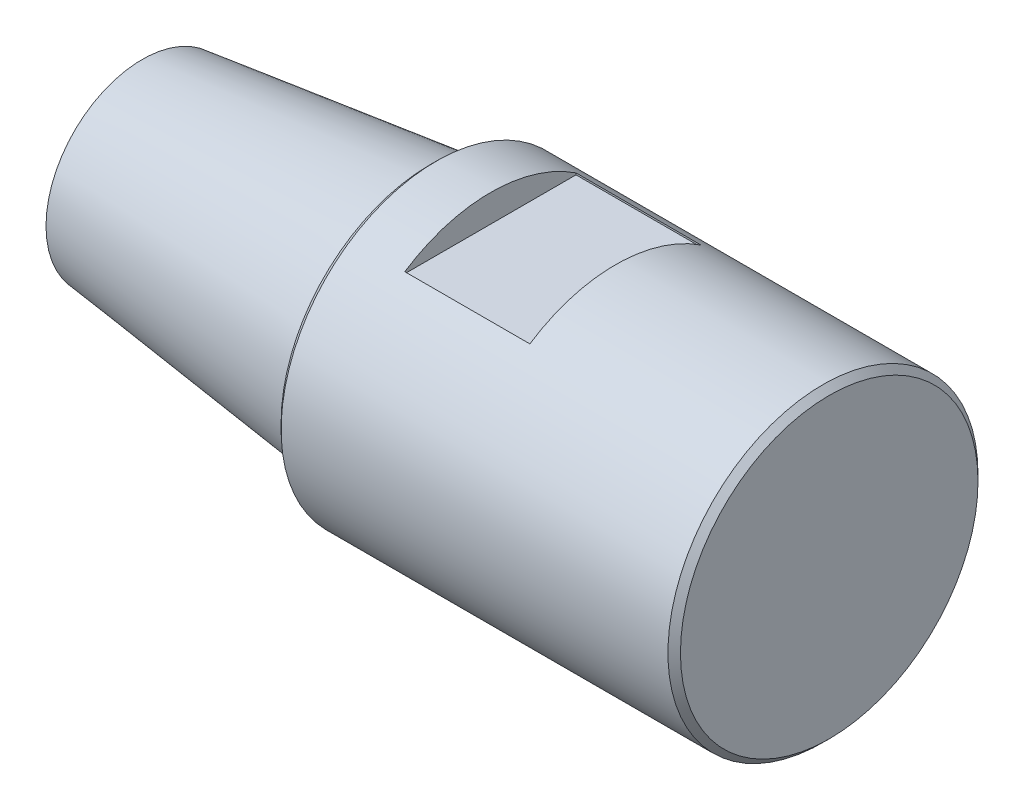
ISO-10303-21;
HEADER;
FILE_DESCRIPTION(('STEP AP214'),'2;1');
FILE_NAME('part.step','',(''),(''),'','','');
FILE_SCHEMA(('AUTOMOTIVE_DESIGN { 1 0 10303 214 1 1 1 1 }'));
ENDSEC;
DATA;
#1=APPLICATION_CONTEXT('core data for automotive mechanical design processes');
#2=APPLICATION_PROTOCOL_DEFINITION('international standard','automotive_design',2000,#1);
#3=PRODUCT_CONTEXT('',#1,'mechanical');
#4=PRODUCT('Part','Part','',(#3));
#5=PRODUCT_RELATED_PRODUCT_CATEGORY('part','',(#4));
#6=PRODUCT_DEFINITION_FORMATION('','',#4);
#7=PRODUCT_DEFINITION_CONTEXT('part definition',#1,'design');
#8=PRODUCT_DEFINITION('design','',#6,#7);
#9=PRODUCT_DEFINITION_SHAPE('','',#8);
#10=(LENGTH_UNIT() NAMED_UNIT(*) SI_UNIT(.MILLI.,.METRE.));
#11=(NAMED_UNIT(*) PLANE_ANGLE_UNIT() SI_UNIT($,.RADIAN.));
#12=(NAMED_UNIT(*) SI_UNIT($,.STERADIAN.) SOLID_ANGLE_UNIT());
#13=UNCERTAINTY_MEASURE_WITH_UNIT(LENGTH_MEASURE(1.E-05),#10,'distance_accuracy_value','');
#14=(GEOMETRIC_REPRESENTATION_CONTEXT(3) GLOBAL_UNCERTAINTY_ASSIGNED_CONTEXT((#13)) GLOBAL_UNIT_ASSIGNED_CONTEXT((#10,
#11,#12)) REPRESENTATION_CONTEXT('',''));
#15=CARTESIAN_POINT('',(0.,0.,0.));
#16=DIRECTION('',(0.,0.,1.));
#17=DIRECTION('',(1.,0.,0.));
#18=AXIS2_PLACEMENT_3D('',#15,#16,#17);
#19=CARTESIAN_POINT('',(0.,0.,0.));
#20=DIRECTION('',(1.,0.,0.));
#21=DIRECTION('',(0.,0.,-1.));
#22=AXIS2_PLACEMENT_3D('',#19,#20,#21);
#23=CONICAL_SURFACE('',#22,20.905,0.119107455666837);
#24=CARTESIAN_POINT('',(-46.,0.,0.));
#25=DIRECTION('',(-1.,0.,0.));
#26=DIRECTION('',(0.,0.,1.));
#27=AXIS2_PLACEMENT_3D('',#24,#25,#26);
#28=CIRCLE('',#27,15.4);
#29=CARTESIAN_POINT('',(-46.,0.,15.4));
#30=VERTEX_POINT('',#29);
#31=EDGE_CURVE('E169',#30,#30,#28,.T.);
#32=ORIENTED_EDGE('',*,*,#31,.F.);
#33=EDGE_LOOP('',(#32));
#34=FACE_BOUND('',#33,.T.);
#35=CARTESIAN_POINT('',(0.,0.,0.));
#36=DIRECTION('',(1.,0.,0.));
#37=DIRECTION('',(0.,0.,-1.));
#38=AXIS2_PLACEMENT_3D('',#35,#36,#37);
#39=CIRCLE('',#38,20.905);
#40=CARTESIAN_POINT('',(0.,0.,-20.905));
#41=VERTEX_POINT('',#40);
#42=EDGE_CURVE('E159',#41,#41,#39,.T.);
#43=ORIENTED_EDGE('',*,*,#42,.F.);
#44=EDGE_LOOP('',(#43));
#45=FACE_BOUND('',#44,.T.);
#46=ADVANCED_FACE('F43',(#34,#45),#23,.T.);
#47=CARTESIAN_POINT('',(-46.,0.,0.));
#48=DIRECTION('',(1.,0.,0.));
#49=DIRECTION('',(0.,0.,-1.));
#50=AXIS2_PLACEMENT_3D('',#47,#48,#49);
#51=PLANE('',#50);
#52=ORIENTED_EDGE('',*,*,#31,.T.);
#53=EDGE_LOOP('',(#52));
#54=FACE_BOUND('',#53,.T.);
#55=ADVANCED_FACE('F212',(#54),#51,.F.);
#56=CARTESIAN_POINT('',(0.,0.,0.));
#57=DIRECTION('',(1.,0.,0.));
#58=DIRECTION('',(0.,0.,-1.));
#59=AXIS2_PLACEMENT_3D('',#56,#57,#58);
#60=PLANE('',#59);
#61=CARTESIAN_POINT('',(0.,0.,0.));
#62=DIRECTION('',(1.,0.,0.));
#63=DIRECTION('',(0.,0.,-1.));
#64=AXIS2_PLACEMENT_3D('',#61,#62,#63);
#65=CIRCLE('',#64,23.795);
#66=CARTESIAN_POINT('',(0.,0.,-23.795));
#67=VERTEX_POINT('',#66);
#68=EDGE_CURVE('E11',#67,#67,#65,.F.);
#69=ORIENTED_EDGE('',*,*,#68,.T.);
#70=EDGE_LOOP('',(#69));
#71=FACE_BOUND('',#70,.T.);
#72=ORIENTED_EDGE('',*,*,#42,.T.);
#73=EDGE_LOOP('',(#72));
#74=FACE_BOUND('',#73,.T.);
#75=ADVANCED_FACE('F208',(#71,#74),#60,.F.);
#76=CARTESIAN_POINT('',(63.87,0.,0.));
#77=DIRECTION('',(-1.,0.,0.));
#78=DIRECTION('',(0.,0.,1.));
#79=AXIS2_PLACEMENT_3D('',#76,#77,#78);
#80=CYLINDRICAL_SURFACE('',#79,24.795);
#81=CARTESIAN_POINT('',(62.87,0.,0.));
#82=DIRECTION('',(1.,0.,0.));
#83=DIRECTION('',(0.,0.,-1.));
#84=AXIS2_PLACEMENT_3D('',#81,#82,#83);
#85=CIRCLE('',#84,24.795);
#86=CARTESIAN_POINT('',(62.87,0.,-24.795));
#87=VERTEX_POINT('',#86);
#88=EDGE_CURVE('E51',#87,#87,#85,.F.);
#89=ORIENTED_EDGE('',*,*,#88,.T.);
#90=EDGE_LOOP('',(#89));
#91=FACE_BOUND('',#90,.T.);
#92=CARTESIAN_POINT('',(0.999999999999987,0.,0.));
#93=DIRECTION('',(1.,0.,0.));
#94=DIRECTION('',(0.,0.,-1.));
#95=AXIS2_PLACEMENT_3D('',#92,#93,#94);
#96=CIRCLE('',#95,24.795);
#97=CARTESIAN_POINT('',(0.999999999999987,0.,-24.795));
#98=VERTEX_POINT('',#97);
#99=EDGE_CURVE('E185',#98,#98,#96,.T.);
#100=ORIENTED_EDGE('',*,*,#99,.T.);
#101=EDGE_LOOP('',(#100));
#102=FACE_BOUND('',#101,.T.);
#103=DIRECTION('',(-1.,0.,0.));
#104=VECTOR('',#103,1.);
#105=CARTESIAN_POINT('',(63.87,-20.673072461538,13.69));
#106=LINE('',#105,#104);
#107=CARTESIAN_POINT('',(9.68,-20.673072461538,13.69));
#108=VERTEX_POINT('',#107);
#109=CARTESIAN_POINT('',(29.68,-20.673072461538,13.69));
#110=VERTEX_POINT('',#109);
#111=EDGE_CURVE('E117',#108,#110,#106,.F.);
#112=ORIENTED_EDGE('',*,*,#111,.T.);
#113=CARTESIAN_POINT('',(29.68,0.,0.));
#114=DIRECTION('',(1.,0.,0.));
#115=DIRECTION('',(0.,0.,1.));
#116=AXIS2_PLACEMENT_3D('',#113,#114,#115);
#117=CIRCLE('',#116,24.795);
#118=CARTESIAN_POINT('',(29.68,-20.673072461538,-13.69));
#119=VERTEX_POINT('',#118);
#120=EDGE_CURVE('E58',#110,#119,#117,.T.);
#121=ORIENTED_EDGE('',*,*,#120,.T.);
#122=DIRECTION('',(-1.,0.,0.));
#123=VECTOR('',#122,1.);
#124=CARTESIAN_POINT('',(63.87,-20.673072461538,-13.69));
#125=LINE('',#124,#123);
#126=CARTESIAN_POINT('',(9.68,-20.673072461538,-13.69));
#127=VERTEX_POINT('',#126);
#128=EDGE_CURVE('E140',#119,#127,#125,.T.);
#129=ORIENTED_EDGE('',*,*,#128,.T.);
#130=CARTESIAN_POINT('',(9.68,0.,0.));
#131=DIRECTION('',(-1.,0.,0.));
#132=DIRECTION('',(0.,0.,-1.));
#133=AXIS2_PLACEMENT_3D('',#130,#131,#132);
#134=CIRCLE('',#133,24.795);
#135=EDGE_CURVE('E131',#127,#108,#134,.T.);
#136=ORIENTED_EDGE('',*,*,#135,.T.);
#137=EDGE_LOOP('',(#112,#121,#129,#136));
#138=FACE_BOUND('',#137,.T.);
#139=DIRECTION('',(-1.,0.,0.));
#140=VECTOR('',#139,1.);
#141=CARTESIAN_POINT('',(63.87,20.673072461538,13.69));
#142=LINE('',#141,#140);
#143=CARTESIAN_POINT('',(29.68,20.673072461538,13.69));
#144=VERTEX_POINT('',#143);
#145=CARTESIAN_POINT('',(9.68,20.673072461538,13.69));
#146=VERTEX_POINT('',#145);
#147=EDGE_CURVE('E179',#144,#146,#142,.T.);
#148=ORIENTED_EDGE('',*,*,#147,.T.);
#149=CARTESIAN_POINT('',(9.68,0.,0.));
#150=DIRECTION('',(-1.,0.,0.));
#151=DIRECTION('',(0.,0.,1.));
#152=AXIS2_PLACEMENT_3D('',#149,#150,#151);
#153=CIRCLE('',#152,24.795);
#154=CARTESIAN_POINT('',(9.68,20.673072461538,-13.69));
#155=VERTEX_POINT('',#154);
#156=EDGE_CURVE('E172',#146,#155,#153,.T.);
#157=ORIENTED_EDGE('',*,*,#156,.T.);
#158=DIRECTION('',(-1.,0.,0.));
#159=VECTOR('',#158,1.);
#160=CARTESIAN_POINT('',(63.87,20.673072461538,-13.69));
#161=LINE('',#160,#159);
#162=CARTESIAN_POINT('',(29.68,20.673072461538,-13.69));
#163=VERTEX_POINT('',#162);
#164=EDGE_CURVE('E176',#155,#163,#161,.F.);
#165=ORIENTED_EDGE('',*,*,#164,.T.);
#166=CARTESIAN_POINT('',(29.68,0.,0.));
#167=DIRECTION('',(1.,0.,0.));
#168=DIRECTION('',(0.,0.,-1.));
#169=AXIS2_PLACEMENT_3D('',#166,#167,#168);
#170=CIRCLE('',#169,24.795);
#171=EDGE_CURVE('E66',#163,#144,#170,.T.);
#172=ORIENTED_EDGE('',*,*,#171,.T.);
#173=EDGE_LOOP('',(#148,#157,#165,#172));
#174=FACE_BOUND('',#173,.T.);
#175=ADVANCED_FACE('F190',(#91,#102,#138,#174),#80,.T.);
#176=CARTESIAN_POINT('',(63.87,0.,0.));
#177=DIRECTION('',(1.,0.,0.));
#178=DIRECTION('',(0.,0.,-1.));
#179=AXIS2_PLACEMENT_3D('',#176,#177,#178);
#180=PLANE('',#179);
#181=CARTESIAN_POINT('',(63.87,0.,0.));
#182=DIRECTION('',(1.,0.,0.));
#183=DIRECTION('',(0.,0.,-1.));
#184=AXIS2_PLACEMENT_3D('',#181,#182,#183);
#185=CIRCLE('',#184,23.795);
#186=CARTESIAN_POINT('',(63.87,0.,-23.795));
#187=VERTEX_POINT('',#186);
#188=EDGE_CURVE('E182',#187,#187,#185,.T.);
#189=ORIENTED_EDGE('',*,*,#188,.T.);
#190=EDGE_LOOP('',(#189));
#191=FACE_BOUND('',#190,.T.);
#192=ADVANCED_FACE('F198',(#191),#180,.T.);
#193=CARTESIAN_POINT('',(29.68,20.395,13.69));
#194=DIRECTION('',(1.,0.,0.));
#195=DIRECTION('',(0.,0.,-1.));
#196=AXIS2_PLACEMENT_3D('',#193,#194,#195);
#197=PLANE('',#196);
#198=DIRECTION('',(0.,1.,0.));
#199=VECTOR('',#198,1.);
#200=CARTESIAN_POINT('',(29.68,20.395,-13.69));
#201=LINE('',#200,#199);
#202=CARTESIAN_POINT('',(29.68,20.395,-13.69));
#203=VERTEX_POINT('',#202);
#204=EDGE_CURVE('E156',#203,#163,#201,.T.);
#205=ORIENTED_EDGE('',*,*,#204,.F.);
#206=DIRECTION('',(0.,0.,-1.));
#207=VECTOR('',#206,1.);
#208=CARTESIAN_POINT('',(29.68,20.395,13.69));
#209=LINE('',#208,#207);
#210=CARTESIAN_POINT('',(29.68,20.395,13.69));
#211=VERTEX_POINT('',#210);
#212=EDGE_CURVE('E144',#211,#203,#209,.T.);
#213=ORIENTED_EDGE('',*,*,#212,.F.);
#214=DIRECTION('',(0.,1.,0.));
#215=VECTOR('',#214,1.);
#216=CARTESIAN_POINT('',(29.68,20.395,13.69));
#217=LINE('',#216,#215);
#218=EDGE_CURVE('E157',#211,#144,#217,.T.);
#219=ORIENTED_EDGE('',*,*,#218,.T.);
#220=ORIENTED_EDGE('',*,*,#171,.F.);
#221=EDGE_LOOP('',(#205,#213,#219,#220));
#222=FACE_BOUND('',#221,.T.);
#223=ADVANCED_FACE('F200',(#222),#197,.F.);
#224=CARTESIAN_POINT('',(9.68,20.395,13.69));
#225=DIRECTION('',(0.,0.,1.));
#226=DIRECTION('',(1.,0.,0.));
#227=AXIS2_PLACEMENT_3D('',#224,#225,#226);
#228=PLANE('',#227);
#229=ORIENTED_EDGE('',*,*,#218,.F.);
#230=DIRECTION('',(1.,0.,0.));
#231=VECTOR('',#230,1.);
#232=CARTESIAN_POINT('',(9.68,20.395,13.69));
#233=LINE('',#232,#231);
#234=CARTESIAN_POINT('',(9.68,20.395,13.69));
#235=VERTEX_POINT('',#234);
#236=EDGE_CURVE('E153',#235,#211,#233,.T.);
#237=ORIENTED_EDGE('',*,*,#236,.F.);
#238=DIRECTION('',(0.,1.,0.));
#239=VECTOR('',#238,1.);
#240=CARTESIAN_POINT('',(9.68,20.395,13.69));
#241=LINE('',#240,#239);
#242=EDGE_CURVE('E160',#235,#146,#241,.T.);
#243=ORIENTED_EDGE('',*,*,#242,.T.);
#244=ORIENTED_EDGE('',*,*,#147,.F.);
#245=EDGE_LOOP('',(#229,#237,#243,#244));
#246=FACE_BOUND('',#245,.T.);
#247=ADVANCED_FACE('F206',(#246),#228,.F.);
#248=CARTESIAN_POINT('',(9.68,20.395,13.69));
#249=DIRECTION('',(-1.,0.,0.));
#250=DIRECTION('',(0.,0.,1.));
#251=AXIS2_PLACEMENT_3D('',#248,#249,#250);
#252=PLANE('',#251);
#253=ORIENTED_EDGE('',*,*,#242,.F.);
#254=DIRECTION('',(0.,0.,1.));
#255=VECTOR('',#254,1.);
#256=CARTESIAN_POINT('',(9.68,20.395,13.69));
#257=LINE('',#256,#255);
#258=CARTESIAN_POINT('',(9.68,20.395,-13.69));
#259=VERTEX_POINT('',#258);
#260=EDGE_CURVE('E150',#259,#235,#257,.T.);
#261=ORIENTED_EDGE('',*,*,#260,.F.);
#262=DIRECTION('',(0.,1.,0.));
#263=VECTOR('',#262,1.);
#264=CARTESIAN_POINT('',(9.68,20.395,-13.69));
#265=LINE('',#264,#263);
#266=EDGE_CURVE('E163',#259,#155,#265,.T.);
#267=ORIENTED_EDGE('',*,*,#266,.T.);
#268=ORIENTED_EDGE('',*,*,#156,.F.);
#269=EDGE_LOOP('',(#253,#261,#267,#268));
#270=FACE_BOUND('',#269,.T.);
#271=ADVANCED_FACE('F243',(#270),#252,.F.);
#272=CARTESIAN_POINT('',(9.68,20.395,-13.69));
#273=DIRECTION('',(0.,0.,-1.));
#274=DIRECTION('',(-1.,0.,0.));
#275=AXIS2_PLACEMENT_3D('',#272,#273,#274);
#276=PLANE('',#275);
#277=ORIENTED_EDGE('',*,*,#266,.F.);
#278=DIRECTION('',(-1.,0.,0.));
#279=VECTOR('',#278,1.);
#280=CARTESIAN_POINT('',(9.68,20.395,-13.69));
#281=LINE('',#280,#279);
#282=EDGE_CURVE('E147',#203,#259,#281,.T.);
#283=ORIENTED_EDGE('',*,*,#282,.F.);
#284=ORIENTED_EDGE('',*,*,#204,.T.);
#285=ORIENTED_EDGE('',*,*,#164,.F.);
#286=EDGE_LOOP('',(#277,#283,#284,#285));
#287=FACE_BOUND('',#286,.T.);
#288=ADVANCED_FACE('F245',(#287),#276,.F.);
#289=CARTESIAN_POINT('',(0.,20.395,0.));
#290=DIRECTION('',(0.,-1.,0.));
#291=DIRECTION('',(0.,0.,-1.));
#292=AXIS2_PLACEMENT_3D('',#289,#290,#291);
#293=PLANE('',#292);
#294=ORIENTED_EDGE('',*,*,#212,.T.);
#295=ORIENTED_EDGE('',*,*,#282,.T.);
#296=ORIENTED_EDGE('',*,*,#260,.T.);
#297=ORIENTED_EDGE('',*,*,#236,.T.);
#298=EDGE_LOOP('',(#294,#295,#296,#297));
#299=FACE_BOUND('',#298,.T.);
#300=ADVANCED_FACE('F240',(#299),#293,.F.);
#301=CARTESIAN_POINT('',(29.68,-20.395,-13.69));
#302=DIRECTION('',(1.,0.,0.));
#303=DIRECTION('',(0.,0.,1.));
#304=AXIS2_PLACEMENT_3D('',#301,#302,#303);
#305=PLANE('',#304);
#306=DIRECTION('',(0.,-1.,0.));
#307=VECTOR('',#306,1.);
#308=CARTESIAN_POINT('',(29.68,-20.395,13.69));
#309=LINE('',#308,#307);
#310=CARTESIAN_POINT('',(29.68,-20.395,13.69));
#311=VERTEX_POINT('',#310);
#312=EDGE_CURVE('E122',#311,#110,#309,.T.);
#313=ORIENTED_EDGE('',*,*,#312,.F.);
#314=DIRECTION('',(0.,0.,1.));
#315=VECTOR('',#314,1.);
#316=CARTESIAN_POINT('',(29.68,-20.395,-13.69));
#317=LINE('',#316,#315);
#318=CARTESIAN_POINT('',(29.68,-20.395,-13.69));
#319=VERTEX_POINT('',#318);
#320=EDGE_CURVE('E109',#319,#311,#317,.T.);
#321=ORIENTED_EDGE('',*,*,#320,.F.);
#322=DIRECTION('',(0.,-1.,0.));
#323=VECTOR('',#322,1.);
#324=CARTESIAN_POINT('',(29.68,-20.395,-13.69));
#325=LINE('',#324,#323);
#326=EDGE_CURVE('E138',#319,#119,#325,.T.);
#327=ORIENTED_EDGE('',*,*,#326,.T.);
#328=ORIENTED_EDGE('',*,*,#120,.F.);
#329=EDGE_LOOP('',(#313,#321,#327,#328));
#330=FACE_BOUND('',#329,.T.);
#331=ADVANCED_FACE('F128',(#330),#305,.F.);
#332=CARTESIAN_POINT('',(9.68,-20.395,-13.69));
#333=DIRECTION('',(0.,0.,-1.));
#334=DIRECTION('',(1.,0.,0.));
#335=AXIS2_PLACEMENT_3D('',#332,#333,#334);
#336=PLANE('',#335);
#337=ORIENTED_EDGE('',*,*,#326,.F.);
#338=DIRECTION('',(1.,0.,0.));
#339=VECTOR('',#338,1.);
#340=CARTESIAN_POINT('',(9.68,-20.395,-13.69));
#341=LINE('',#340,#339);
#342=CARTESIAN_POINT('',(9.68,-20.395,-13.69));
#343=VERTEX_POINT('',#342);
#344=EDGE_CURVE('E115',#343,#319,#341,.T.);
#345=ORIENTED_EDGE('',*,*,#344,.F.);
#346=DIRECTION('',(0.,-1.,0.));
#347=VECTOR('',#346,1.);
#348=CARTESIAN_POINT('',(9.68,-20.395,-13.69));
#349=LINE('',#348,#347);
#350=EDGE_CURVE('E129',#343,#127,#349,.T.);
#351=ORIENTED_EDGE('',*,*,#350,.T.);
#352=ORIENTED_EDGE('',*,*,#128,.F.);
#353=EDGE_LOOP('',(#337,#345,#351,#352));
#354=FACE_BOUND('',#353,.T.);
#355=ADVANCED_FACE('F259',(#354),#336,.F.);
#356=CARTESIAN_POINT('',(9.68,-20.395,-13.69));
#357=DIRECTION('',(-1.,0.,0.));
#358=DIRECTION('',(0.,0.,-1.));
#359=AXIS2_PLACEMENT_3D('',#356,#357,#358);
#360=PLANE('',#359);
#361=ORIENTED_EDGE('',*,*,#350,.F.);
#362=DIRECTION('',(0.,0.,-1.));
#363=VECTOR('',#362,1.);
#364=CARTESIAN_POINT('',(9.68,-20.395,-13.69));
#365=LINE('',#364,#363);
#366=CARTESIAN_POINT('',(9.68,-20.395,13.69));
#367=VERTEX_POINT('',#366);
#368=EDGE_CURVE('E126',#367,#343,#365,.T.);
#369=ORIENTED_EDGE('',*,*,#368,.F.);
#370=DIRECTION('',(0.,-1.,0.));
#371=VECTOR('',#370,1.);
#372=CARTESIAN_POINT('',(9.68,-20.395,13.69));
#373=LINE('',#372,#371);
#374=EDGE_CURVE('E125',#367,#108,#373,.T.);
#375=ORIENTED_EDGE('',*,*,#374,.T.);
#376=ORIENTED_EDGE('',*,*,#135,.F.);
#377=EDGE_LOOP('',(#361,#369,#375,#376));
#378=FACE_BOUND('',#377,.T.);
#379=ADVANCED_FACE('F262',(#378),#360,.F.);
#380=CARTESIAN_POINT('',(9.68,-20.395,13.69));
#381=DIRECTION('',(0.,0.,1.));
#382=DIRECTION('',(-1.,0.,0.));
#383=AXIS2_PLACEMENT_3D('',#380,#381,#382);
#384=PLANE('',#383);
#385=ORIENTED_EDGE('',*,*,#374,.F.);
#386=DIRECTION('',(-1.,0.,0.));
#387=VECTOR('',#386,1.);
#388=CARTESIAN_POINT('',(9.68,-20.395,13.69));
#389=LINE('',#388,#387);
#390=EDGE_CURVE('E112',#311,#367,#389,.T.);
#391=ORIENTED_EDGE('',*,*,#390,.F.);
#392=ORIENTED_EDGE('',*,*,#312,.T.);
#393=ORIENTED_EDGE('',*,*,#111,.F.);
#394=EDGE_LOOP('',(#385,#391,#392,#393));
#395=FACE_BOUND('',#394,.T.);
#396=ADVANCED_FACE('F121',(#395),#384,.F.);
#397=CARTESIAN_POINT('',(0.,-20.395,0.));
#398=DIRECTION('',(0.,1.,0.));
#399=DIRECTION('',(0.,0.,1.));
#400=AXIS2_PLACEMENT_3D('',#397,#398,#399);
#401=PLANE('',#400);
#402=ORIENTED_EDGE('',*,*,#320,.T.);
#403=ORIENTED_EDGE('',*,*,#390,.T.);
#404=ORIENTED_EDGE('',*,*,#368,.T.);
#405=ORIENTED_EDGE('',*,*,#344,.T.);
#406=EDGE_LOOP('',(#402,#403,#404,#405));
#407=FACE_BOUND('',#406,.T.);
#408=ADVANCED_FACE('F111',(#407),#401,.F.);
#409=CARTESIAN_POINT('',(63.87,0.,0.));
#410=DIRECTION('',(-1.,0.,0.));
#411=DIRECTION('',(0.,0.,1.));
#412=AXIS2_PLACEMENT_3D('',#409,#410,#411);
#413=CONICAL_SURFACE('',#412,23.795,0.785398163397445);
#414=ORIENTED_EDGE('',*,*,#88,.F.);
#415=EDGE_LOOP('',(#414));
#416=FACE_BOUND('',#415,.T.);
#417=ORIENTED_EDGE('',*,*,#188,.F.);
#418=EDGE_LOOP('',(#417));
#419=FACE_BOUND('',#418,.T.);
#420=ADVANCED_FACE('F193',(#416,#419),#413,.T.);
#421=CARTESIAN_POINT('',(0.999999999999987,0.,0.));
#422=DIRECTION('',(1.,0.,0.));
#423=DIRECTION('',(0.,0.,-1.));
#424=AXIS2_PLACEMENT_3D('',#421,#422,#423);
#425=CONICAL_SURFACE('',#424,24.795,0.78539816339745);
#426=ORIENTED_EDGE('',*,*,#68,.F.);
#427=EDGE_LOOP('',(#426));
#428=FACE_BOUND('',#427,.T.);
#429=ORIENTED_EDGE('',*,*,#99,.F.);
#430=EDGE_LOOP('',(#429));
#431=FACE_BOUND('',#430,.T.);
#432=ADVANCED_FACE('F45',(#428,#431),#425,.T.);
#433=CLOSED_SHELL('',(#46,#55,#75,#175,#192,#223,#247,#271,#288,#300,#331,#355,#379,#396,#408,
#420,#432));
#434=MANIFOLD_SOLID_BREP('B2',#433);
#435=ADVANCED_BREP_SHAPE_REPRESENTATION('',(#18,#434),#14);
#436=SHAPE_DEFINITION_REPRESENTATION(#9,#435);
ENDSEC;
END-ISO-10303-21;
